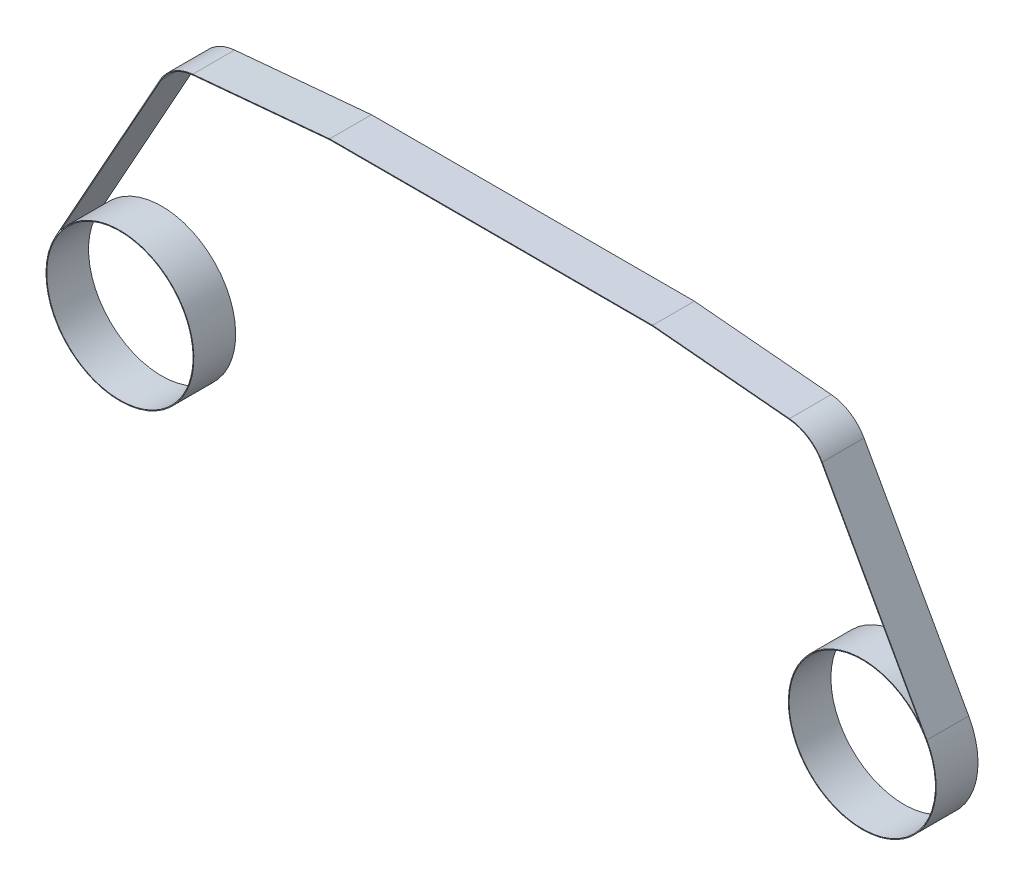
ISO-10303-21;
HEADER;
FILE_DESCRIPTION(('STEP AP214'),'2;1');
FILE_NAME('part.step','',(''),(''),'','','');
FILE_SCHEMA(('AUTOMOTIVE_DESIGN { 1 0 10303 214 1 1 1 1 }'));
ENDSEC;
DATA;
#1=APPLICATION_CONTEXT('core data for automotive mechanical design processes');
#2=APPLICATION_PROTOCOL_DEFINITION('international standard','automotive_design',2000,#1);
#3=PRODUCT_CONTEXT('',#1,'mechanical');
#4=PRODUCT('Part','Part','',(#3));
#5=PRODUCT_RELATED_PRODUCT_CATEGORY('part','',(#4));
#6=PRODUCT_DEFINITION_FORMATION('','',#4);
#7=PRODUCT_DEFINITION_CONTEXT('part definition',#1,'design');
#8=PRODUCT_DEFINITION('design','',#6,#7);
#9=PRODUCT_DEFINITION_SHAPE('','',#8);
#10=(LENGTH_UNIT() NAMED_UNIT(*) SI_UNIT(.MILLI.,.METRE.));
#11=(NAMED_UNIT(*) PLANE_ANGLE_UNIT() SI_UNIT($,.RADIAN.));
#12=(NAMED_UNIT(*) SI_UNIT($,.STERADIAN.) SOLID_ANGLE_UNIT());
#13=UNCERTAINTY_MEASURE_WITH_UNIT(LENGTH_MEASURE(1.E-05),#10,'distance_accuracy_value','');
#14=(GEOMETRIC_REPRESENTATION_CONTEXT(3) GLOBAL_UNCERTAINTY_ASSIGNED_CONTEXT((#13)) GLOBAL_UNIT_ASSIGNED_CONTEXT((#10,
#11,#12)) REPRESENTATION_CONTEXT('',''));
#15=CARTESIAN_POINT('',(0.,0.,0.));
#16=DIRECTION('',(0.,0.,1.));
#17=DIRECTION('',(1.,0.,0.));
#18=AXIS2_PLACEMENT_3D('',#15,#16,#17);
#19=CARTESIAN_POINT('',(35.5,0.,2.));
#20=DIRECTION('',(0.,0.,-1.));
#21=DIRECTION('',(-1.,0.,0.));
#22=AXIS2_PLACEMENT_3D('',#19,#20,#21);
#23=PLANE('',#22);
#24=CARTESIAN_POINT('',(-35.5,0.,2.));
#25=DIRECTION('',(0.,0.,1.));
#26=DIRECTION('',(1.,0.,0.));
#27=AXIS2_PLACEMENT_3D('',#24,#25,#26);
#28=CIRCLE('',#27,7.);
#29=CARTESIAN_POINT('',(-28.5,0.,2.));
#30=VERTEX_POINT('',#29);
#31=EDGE_CURVE('E183',#30,#30,#28,.T.);
#32=ORIENTED_EDGE('',*,*,#31,.F.);
#33=EDGE_LOOP('',(#32));
#34=FACE_BOUND('',#33,.T.);
#35=CARTESIAN_POINT('',(35.5,0.,2.));
#36=DIRECTION('',(0.,0.,1.));
#37=DIRECTION('',(-1.,0.,0.));
#38=AXIS2_PLACEMENT_3D('',#35,#36,#37);
#39=CIRCLE('',#38,7.06999999999999);
#40=CARTESIAN_POINT('',(41.1355776537474,4.26909410865856,2.));
#41=VERTEX_POINT('',#40);
#42=CARTESIAN_POINT('',(41.679035844759,3.43575552523505,2.));
#43=VERTEX_POINT('',#42);
#44=EDGE_CURVE('E210',#41,#43,#39,.T.);
#45=ORIENTED_EDGE('',*,*,#44,.T.);
#46=DIRECTION('',(-0.485962591971012,0.873979610291233,0.));
#47=VECTOR('',#46,1.);
#48=CARTESIAN_POINT('',(31.6659184411649,21.443850367884,2.));
#49=LINE('',#48,#47);
#50=CARTESIAN_POINT('',(31.6659184411649,21.443850367884,2.));
#51=VERTEX_POINT('',#50);
#52=EDGE_CURVE('E118',#43,#51,#49,.T.);
#53=ORIENTED_EDGE('',*,*,#52,.T.);
#54=CARTESIAN_POINT('',(28.17,19.5,2.));
#55=DIRECTION('',(0.,0.,1.));
#56=DIRECTION('',(-1.,0.,0.));
#57=AXIS2_PLACEMENT_3D('',#54,#55,#56);
#58=CIRCLE('',#57,4.);
#59=CARTESIAN_POINT('',(28.5310758735914,23.4836696918181,2.));
#60=VERTEX_POINT('',#59);
#61=EDGE_CURVE('E249',#51,#60,#58,.T.);
#62=ORIENTED_EDGE('',*,*,#61,.T.);
#63=DIRECTION('',(-0.995917422954527,0.0902689683978592,0.));
#64=VECTOR('',#63,1.);
#65=CARTESIAN_POINT('',(28.5310758735914,23.4836696918181,2.));
#66=LINE('',#65,#64);
#67=CARTESIAN_POINT('',(15.44255781177,24.67,2.));
#68=VERTEX_POINT('',#67);
#69=EDGE_CURVE('E268',#60,#68,#66,.T.);
#70=ORIENTED_EDGE('',*,*,#69,.T.);
#71=DIRECTION('',(-1.,0.,0.));
#72=VECTOR('',#71,1.);
#73=CARTESIAN_POINT('',(-15.44255781177,24.67,2.));
#74=LINE('',#73,#72);
#75=CARTESIAN_POINT('',(-15.44255781177,24.67,2.));
#76=VERTEX_POINT('',#75);
#77=EDGE_CURVE('E265',#68,#76,#74,.T.);
#78=ORIENTED_EDGE('',*,*,#77,.T.);
#79=DIRECTION('',(-0.995917422954527,-0.0902689683978592,0.));
#80=VECTOR('',#79,1.);
#81=CARTESIAN_POINT('',(-28.5310758735914,23.4836696918181,2.));
#82=LINE('',#81,#80);
#83=CARTESIAN_POINT('',(-28.5310758735914,23.4836696918181,2.));
#84=VERTEX_POINT('',#83);
#85=EDGE_CURVE('E267',#76,#84,#82,.T.);
#86=ORIENTED_EDGE('',*,*,#85,.T.);
#87=CARTESIAN_POINT('',(-28.17,19.5,2.));
#88=DIRECTION('',(0.,0.,1.));
#89=DIRECTION('',(1.,0.,0.));
#90=AXIS2_PLACEMENT_3D('',#87,#88,#89);
#91=CIRCLE('',#90,4.);
#92=CARTESIAN_POINT('',(-31.6659184411649,21.443850367884,2.));
#93=VERTEX_POINT('',#92);
#94=EDGE_CURVE('E270',#84,#93,#91,.T.);
#95=ORIENTED_EDGE('',*,*,#94,.T.);
#96=DIRECTION('',(-0.485962591971012,-0.873979610291233,0.));
#97=VECTOR('',#96,1.);
#98=CARTESIAN_POINT('',(-31.6659184411649,21.443850367884,2.));
#99=LINE('',#98,#97);
#100=CARTESIAN_POINT('',(-41.679035844759,3.43575552523504,2.));
#101=VERTEX_POINT('',#100);
#102=EDGE_CURVE('E276',#93,#101,#99,.T.);
#103=ORIENTED_EDGE('',*,*,#102,.T.);
#104=CARTESIAN_POINT('',(-35.5,0.,2.));
#105=DIRECTION('',(0.,0.,1.));
#106=DIRECTION('',(1.,0.,0.));
#107=AXIS2_PLACEMENT_3D('',#104,#105,#106);
#108=CIRCLE('',#107,7.06999999999999);
#109=CARTESIAN_POINT('',(-41.1355776537474,4.26909410865856,2.));
#110=VERTEX_POINT('',#109);
#111=EDGE_CURVE('E278',#101,#110,#108,.T.);
#112=ORIENTED_EDGE('',*,*,#111,.T.);
#113=DIRECTION('',(0.485962591971012,0.873979610291233,0.));
#114=VECTOR('',#113,1.);
#115=CARTESIAN_POINT('',(-31.6047398684445,21.4098329864461,2.));
#116=LINE('',#115,#114);
#117=CARTESIAN_POINT('',(-31.6047398684445,21.4098329864461,2.));
#118=VERTEX_POINT('',#117);
#119=EDGE_CURVE('E280',#110,#118,#116,.T.);
#120=ORIENTED_EDGE('',*,*,#119,.T.);
#121=CARTESIAN_POINT('',(-28.17,19.5,2.));
#122=DIRECTION('',(0.,0.,-1.));
#123=DIRECTION('',(1.,0.,0.));
#124=AXIS2_PLACEMENT_3D('',#121,#122,#123);
#125=CIRCLE('',#124,3.93);
#126=CARTESIAN_POINT('',(-28.5247570458036,23.4139554722113,2.));
#127=VERTEX_POINT('',#126);
#128=EDGE_CURVE('E282',#118,#127,#125,.T.);
#129=ORIENTED_EDGE('',*,*,#128,.T.);
#130=DIRECTION('',(0.995917422954527,0.0902689683978593,0.));
#131=VECTOR('',#130,1.);
#132=CARTESIAN_POINT('',(-28.5247570458036,23.4139554722113,2.));
#133=LINE('',#132,#131);
#134=CARTESIAN_POINT('',(-15.4393919354091,24.6,2.));
#135=VERTEX_POINT('',#134);
#136=EDGE_CURVE('E284',#127,#135,#133,.T.);
#137=ORIENTED_EDGE('',*,*,#136,.T.);
#138=DIRECTION('',(1.,0.,0.));
#139=VECTOR('',#138,1.);
#140=CARTESIAN_POINT('',(-15.4393919354091,24.6,2.));
#141=LINE('',#140,#139);
#142=CARTESIAN_POINT('',(15.4393919354091,24.6,2.));
#143=VERTEX_POINT('',#142);
#144=EDGE_CURVE('E161',#135,#143,#141,.T.);
#145=ORIENTED_EDGE('',*,*,#144,.T.);
#146=DIRECTION('',(0.995917422954527,-0.0902689683978593,0.));
#147=VECTOR('',#146,1.);
#148=CARTESIAN_POINT('',(28.5247570458036,23.4139554722113,2.));
#149=LINE('',#148,#147);
#150=CARTESIAN_POINT('',(28.5247570458036,23.4139554722113,2.));
#151=VERTEX_POINT('',#150);
#152=EDGE_CURVE('E155',#143,#151,#149,.T.);
#153=ORIENTED_EDGE('',*,*,#152,.T.);
#154=CARTESIAN_POINT('',(28.17,19.5,2.));
#155=DIRECTION('',(0.,0.,-1.));
#156=DIRECTION('',(-1.,0.,0.));
#157=AXIS2_PLACEMENT_3D('',#154,#155,#156);
#158=CIRCLE('',#157,3.93);
#159=CARTESIAN_POINT('',(31.6047398684445,21.4098329864461,2.));
#160=VERTEX_POINT('',#159);
#161=EDGE_CURVE('E159',#151,#160,#158,.T.);
#162=ORIENTED_EDGE('',*,*,#161,.T.);
#163=DIRECTION('',(0.485962591971012,-0.873979610291233,0.));
#164=VECTOR('',#163,1.);
#165=CARTESIAN_POINT('',(31.6047398684445,21.4098329864461,2.));
#166=LINE('',#165,#164);
#167=EDGE_CURVE('E51',#160,#41,#166,.T.);
#168=ORIENTED_EDGE('',*,*,#167,.T.);
#169=EDGE_LOOP('',(#45,#53,#62,#70,#78,#86,#95,#103,#112,#120,#129,#137,#145,#153,#162,#168));
#170=FACE_BOUND('',#169,.T.);
#171=CARTESIAN_POINT('',(35.5,0.,2.));
#172=DIRECTION('',(0.,0.,1.));
#173=DIRECTION('',(-1.,0.,0.));
#174=AXIS2_PLACEMENT_3D('',#171,#172,#173);
#175=CIRCLE('',#174,7.);
#176=CARTESIAN_POINT('',(28.5,0.,2.));
#177=VERTEX_POINT('',#176);
#178=EDGE_CURVE('E327',#177,#177,#175,.T.);
#179=ORIENTED_EDGE('',*,*,#178,.F.);
#180=EDGE_LOOP('',(#179));
#181=FACE_BOUND('',#180,.T.);
#182=ADVANCED_FACE('F34',(#34,#170,#181),#23,.F.);
#183=CARTESIAN_POINT('',(35.5,0.,-2.));
#184=DIRECTION('',(0.,0.,-1.));
#185=DIRECTION('',(-1.,0.,0.));
#186=AXIS2_PLACEMENT_3D('',#183,#184,#185);
#187=PLANE('',#186);
#188=CARTESIAN_POINT('',(-35.5,0.,-2.));
#189=DIRECTION('',(0.,0.,1.));
#190=DIRECTION('',(1.,0.,0.));
#191=AXIS2_PLACEMENT_3D('',#188,#189,#190);
#192=CIRCLE('',#191,7.);
#193=CARTESIAN_POINT('',(-28.5,0.,-2.));
#194=VERTEX_POINT('',#193);
#195=EDGE_CURVE('E332',#194,#194,#192,.T.);
#196=ORIENTED_EDGE('',*,*,#195,.T.);
#197=EDGE_LOOP('',(#196));
#198=FACE_BOUND('',#197,.T.);
#199=CARTESIAN_POINT('',(35.5,0.,-2.));
#200=DIRECTION('',(0.,0.,1.));
#201=DIRECTION('',(-1.,0.,0.));
#202=AXIS2_PLACEMENT_3D('',#199,#200,#201);
#203=CIRCLE('',#202,7.06999999999999);
#204=CARTESIAN_POINT('',(41.1355776537474,4.26909410865856,-2.));
#205=VERTEX_POINT('',#204);
#206=CARTESIAN_POINT('',(41.679035844759,3.43575552523505,-2.));
#207=VERTEX_POINT('',#206);
#208=EDGE_CURVE('E179',#205,#207,#203,.T.);
#209=ORIENTED_EDGE('',*,*,#208,.F.);
#210=DIRECTION('',(0.485962591971012,-0.873979610291233,0.));
#211=VECTOR('',#210,1.);
#212=CARTESIAN_POINT('',(31.6047398684445,21.4098329864461,-2.));
#213=LINE('',#212,#211);
#214=CARTESIAN_POINT('',(31.6047398684445,21.4098329864461,-2.));
#215=VERTEX_POINT('',#214);
#216=EDGE_CURVE('E110',#215,#205,#213,.T.);
#217=ORIENTED_EDGE('',*,*,#216,.F.);
#218=CARTESIAN_POINT('',(28.17,19.5,-2.));
#219=DIRECTION('',(0.,0.,-1.));
#220=DIRECTION('',(-1.,0.,0.));
#221=AXIS2_PLACEMENT_3D('',#218,#219,#220);
#222=CIRCLE('',#221,3.93);
#223=CARTESIAN_POINT('',(28.5247570458036,23.4139554722113,-2.));
#224=VERTEX_POINT('',#223);
#225=EDGE_CURVE('E104',#224,#215,#222,.T.);
#226=ORIENTED_EDGE('',*,*,#225,.F.);
#227=DIRECTION('',(0.995917422954527,-0.0902689683978593,0.));
#228=VECTOR('',#227,1.);
#229=CARTESIAN_POINT('',(28.5247570458036,23.4139554722113,-2.));
#230=LINE('',#229,#228);
#231=CARTESIAN_POINT('',(15.4393919354091,24.6,-2.));
#232=VERTEX_POINT('',#231);
#233=EDGE_CURVE('E169',#232,#224,#230,.T.);
#234=ORIENTED_EDGE('',*,*,#233,.F.);
#235=DIRECTION('',(1.,0.,0.));
#236=VECTOR('',#235,1.);
#237=CARTESIAN_POINT('',(-15.4393919354091,24.6,-2.));
#238=LINE('',#237,#236);
#239=CARTESIAN_POINT('',(-15.4393919354091,24.6,-2.));
#240=VERTEX_POINT('',#239);
#241=EDGE_CURVE('E205',#240,#232,#238,.T.);
#242=ORIENTED_EDGE('',*,*,#241,.F.);
#243=DIRECTION('',(0.995917422954527,0.0902689683978593,0.));
#244=VECTOR('',#243,1.);
#245=CARTESIAN_POINT('',(-28.5247570458036,23.4139554722113,-2.));
#246=LINE('',#245,#244);
#247=CARTESIAN_POINT('',(-28.5247570458036,23.4139554722113,-2.));
#248=VERTEX_POINT('',#247);
#249=EDGE_CURVE('E203',#248,#240,#246,.T.);
#250=ORIENTED_EDGE('',*,*,#249,.F.);
#251=CARTESIAN_POINT('',(-28.17,19.5,-2.));
#252=DIRECTION('',(0.,0.,-1.));
#253=DIRECTION('',(1.,0.,0.));
#254=AXIS2_PLACEMENT_3D('',#251,#252,#253);
#255=CIRCLE('',#254,3.93);
#256=CARTESIAN_POINT('',(-31.6047398684445,21.4098329864461,-2.));
#257=VERTEX_POINT('',#256);
#258=EDGE_CURVE('E201',#257,#248,#255,.T.);
#259=ORIENTED_EDGE('',*,*,#258,.F.);
#260=DIRECTION('',(0.485962591971012,0.873979610291233,0.));
#261=VECTOR('',#260,1.);
#262=CARTESIAN_POINT('',(-31.6047398684445,21.4098329864461,-2.));
#263=LINE('',#262,#261);
#264=CARTESIAN_POINT('',(-41.1355776537474,4.26909410865856,-2.));
#265=VERTEX_POINT('',#264);
#266=EDGE_CURVE('E199',#265,#257,#263,.T.);
#267=ORIENTED_EDGE('',*,*,#266,.F.);
#268=CARTESIAN_POINT('',(-35.5,0.,-2.));
#269=DIRECTION('',(0.,0.,1.));
#270=DIRECTION('',(1.,0.,0.));
#271=AXIS2_PLACEMENT_3D('',#268,#269,#270);
#272=CIRCLE('',#271,7.06999999999999);
#273=CARTESIAN_POINT('',(-41.679035844759,3.43575552523504,-2.));
#274=VERTEX_POINT('',#273);
#275=EDGE_CURVE('E197',#274,#265,#272,.T.);
#276=ORIENTED_EDGE('',*,*,#275,.F.);
#277=DIRECTION('',(-0.485962591971012,-0.873979610291233,0.));
#278=VECTOR('',#277,1.);
#279=CARTESIAN_POINT('',(-31.6659184411649,21.443850367884,-2.));
#280=LINE('',#279,#278);
#281=CARTESIAN_POINT('',(-31.6659184411649,21.443850367884,-2.));
#282=VERTEX_POINT('',#281);
#283=EDGE_CURVE('E195',#282,#274,#280,.T.);
#284=ORIENTED_EDGE('',*,*,#283,.F.);
#285=CARTESIAN_POINT('',(-28.17,19.5,-2.));
#286=DIRECTION('',(0.,0.,1.));
#287=DIRECTION('',(1.,0.,0.));
#288=AXIS2_PLACEMENT_3D('',#285,#286,#287);
#289=CIRCLE('',#288,4.);
#290=CARTESIAN_POINT('',(-28.5310758735914,23.4836696918181,-2.));
#291=VERTEX_POINT('',#290);
#292=EDGE_CURVE('E193',#291,#282,#289,.T.);
#293=ORIENTED_EDGE('',*,*,#292,.F.);
#294=DIRECTION('',(-0.995917422954527,-0.0902689683978592,0.));
#295=VECTOR('',#294,1.);
#296=CARTESIAN_POINT('',(-28.5310758735914,23.4836696918181,-2.));
#297=LINE('',#296,#295);
#298=CARTESIAN_POINT('',(-15.44255781177,24.67,-2.));
#299=VERTEX_POINT('',#298);
#300=EDGE_CURVE('E191',#299,#291,#297,.T.);
#301=ORIENTED_EDGE('',*,*,#300,.F.);
#302=DIRECTION('',(-1.,0.,0.));
#303=VECTOR('',#302,1.);
#304=CARTESIAN_POINT('',(-15.44255781177,24.67,-2.));
#305=LINE('',#304,#303);
#306=CARTESIAN_POINT('',(15.44255781177,24.67,-2.));
#307=VERTEX_POINT('',#306);
#308=EDGE_CURVE('E189',#307,#299,#305,.T.);
#309=ORIENTED_EDGE('',*,*,#308,.F.);
#310=DIRECTION('',(-0.995917422954527,0.0902689683978592,0.));
#311=VECTOR('',#310,1.);
#312=CARTESIAN_POINT('',(28.5310758735914,23.4836696918181,-2.));
#313=LINE('',#312,#311);
#314=CARTESIAN_POINT('',(28.5310758735914,23.4836696918181,-2.));
#315=VERTEX_POINT('',#314);
#316=EDGE_CURVE('E187',#315,#307,#313,.T.);
#317=ORIENTED_EDGE('',*,*,#316,.F.);
#318=CARTESIAN_POINT('',(28.17,19.5,-2.));
#319=DIRECTION('',(0.,0.,1.));
#320=DIRECTION('',(-1.,0.,0.));
#321=AXIS2_PLACEMENT_3D('',#318,#319,#320);
#322=CIRCLE('',#321,4.);
#323=CARTESIAN_POINT('',(31.6659184411649,21.443850367884,-2.));
#324=VERTEX_POINT('',#323);
#325=EDGE_CURVE('E185',#324,#315,#322,.T.);
#326=ORIENTED_EDGE('',*,*,#325,.F.);
#327=DIRECTION('',(-0.485962591971012,0.873979610291233,0.));
#328=VECTOR('',#327,1.);
#329=CARTESIAN_POINT('',(31.6659184411649,21.443850367884,-2.));
#330=LINE('',#329,#328);
#331=EDGE_CURVE('E182',#207,#324,#330,.T.);
#332=ORIENTED_EDGE('',*,*,#331,.F.);
#333=EDGE_LOOP('',(#209,#217,#226,#234,#242,#250,#259,#267,#276,#284,#293,#301,#309,#317,#326,#332));
#334=FACE_BOUND('',#333,.T.);
#335=CARTESIAN_POINT('',(35.5,0.,-2.));
#336=DIRECTION('',(0.,0.,1.));
#337=DIRECTION('',(-1.,0.,0.));
#338=AXIS2_PLACEMENT_3D('',#335,#336,#337);
#339=CIRCLE('',#338,7.);
#340=CARTESIAN_POINT('',(28.5,0.,-2.));
#341=VERTEX_POINT('',#340);
#342=EDGE_CURVE('E330',#341,#341,#339,.T.);
#343=ORIENTED_EDGE('',*,*,#342,.T.);
#344=EDGE_LOOP('',(#343));
#345=FACE_BOUND('',#344,.T.);
#346=ADVANCED_FACE('F253',(#198,#334,#345),#187,.T.);
#347=CARTESIAN_POINT('',(35.5,0.,2.));
#348=DIRECTION('',(0.,0.,-1.));
#349=DIRECTION('',(-1.,0.,0.));
#350=AXIS2_PLACEMENT_3D('',#347,#348,#349);
#351=CYLINDRICAL_SURFACE('',#350,7.06999999999999);
#352=ORIENTED_EDGE('',*,*,#208,.T.);
#353=DIRECTION('',(0.,0.,-1.));
#354=VECTOR('',#353,1.);
#355=CARTESIAN_POINT('',(41.679035844759,3.43575552523505,2.));
#356=LINE('',#355,#354);
#357=EDGE_CURVE('E11',#43,#207,#356,.T.);
#358=ORIENTED_EDGE('',*,*,#357,.F.);
#359=ORIENTED_EDGE('',*,*,#44,.F.);
#360=DIRECTION('',(0.,0.,-1.));
#361=VECTOR('',#360,1.);
#362=CARTESIAN_POINT('',(41.1355776537474,4.26909410865856,2.));
#363=LINE('',#362,#361);
#364=EDGE_CURVE('E175',#41,#205,#363,.T.);
#365=ORIENTED_EDGE('',*,*,#364,.T.);
#366=EDGE_LOOP('',(#352,#358,#359,#365));
#367=FACE_BOUND('',#366,.T.);
#368=ADVANCED_FACE('F36',(#367),#351,.T.);
#369=CARTESIAN_POINT('',(31.6659184411649,21.443850367884,2.));
#370=DIRECTION('',(-0.873979610291233,-0.485962591971012,0.));
#371=DIRECTION('',(0.485962591971012,-0.873979610291233,0.));
#372=AXIS2_PLACEMENT_3D('',#369,#370,#371);
#373=PLANE('',#372);
#374=ORIENTED_EDGE('',*,*,#331,.T.);
#375=DIRECTION('',(0.,0.,-1.));
#376=VECTOR('',#375,1.);
#377=CARTESIAN_POINT('',(31.6659184411649,21.443850367884,2.));
#378=LINE('',#377,#376);
#379=EDGE_CURVE('E43',#51,#324,#378,.T.);
#380=ORIENTED_EDGE('',*,*,#379,.F.);
#381=ORIENTED_EDGE('',*,*,#52,.F.);
#382=ORIENTED_EDGE('',*,*,#357,.T.);
#383=EDGE_LOOP('',(#374,#380,#381,#382));
#384=FACE_BOUND('',#383,.T.);
#385=ADVANCED_FACE('F465',(#384),#373,.F.);
#386=CARTESIAN_POINT('',(28.17,19.5,2.));
#387=DIRECTION('',(0.,0.,-1.));
#388=DIRECTION('',(-1.,0.,0.));
#389=AXIS2_PLACEMENT_3D('',#386,#387,#388);
#390=CYLINDRICAL_SURFACE('',#389,4.);
#391=ORIENTED_EDGE('',*,*,#325,.T.);
#392=DIRECTION('',(0.,0.,-1.));
#393=VECTOR('',#392,1.);
#394=CARTESIAN_POINT('',(28.5310758735914,23.4836696918181,2.));
#395=LINE('',#394,#393);
#396=EDGE_CURVE('E241',#60,#315,#395,.T.);
#397=ORIENTED_EDGE('',*,*,#396,.F.);
#398=ORIENTED_EDGE('',*,*,#61,.F.);
#399=ORIENTED_EDGE('',*,*,#379,.T.);
#400=EDGE_LOOP('',(#391,#397,#398,#399));
#401=FACE_BOUND('',#400,.T.);
#402=ADVANCED_FACE('F247',(#401),#390,.T.);
#403=CARTESIAN_POINT('',(28.5310758735914,23.4836696918181,2.));
#404=DIRECTION('',(-0.0902689683978592,-0.995917422954527,0.));
#405=DIRECTION('',(0.995917422954527,-0.0902689683978592,0.));
#406=AXIS2_PLACEMENT_3D('',#403,#404,#405);
#407=PLANE('',#406);
#408=ORIENTED_EDGE('',*,*,#316,.T.);
#409=DIRECTION('',(0.,0.,-1.));
#410=VECTOR('',#409,1.);
#411=CARTESIAN_POINT('',(15.44255781177,24.67,2.));
#412=LINE('',#411,#410);
#413=EDGE_CURVE('E238',#68,#307,#412,.T.);
#414=ORIENTED_EDGE('',*,*,#413,.F.);
#415=ORIENTED_EDGE('',*,*,#69,.F.);
#416=ORIENTED_EDGE('',*,*,#396,.T.);
#417=EDGE_LOOP('',(#408,#414,#415,#416));
#418=FACE_BOUND('',#417,.T.);
#419=ADVANCED_FACE('F259',(#418),#407,.F.);
#420=CARTESIAN_POINT('',(-15.44255781177,24.67,2.));
#421=DIRECTION('',(0.,-1.,0.));
#422=DIRECTION('',(0.,0.,-1.));
#423=AXIS2_PLACEMENT_3D('',#420,#421,#422);
#424=PLANE('',#423);
#425=ORIENTED_EDGE('',*,*,#308,.T.);
#426=DIRECTION('',(0.,0.,-1.));
#427=VECTOR('',#426,1.);
#428=CARTESIAN_POINT('',(-15.44255781177,24.67,2.));
#429=LINE('',#428,#427);
#430=EDGE_CURVE('E235',#76,#299,#429,.T.);
#431=ORIENTED_EDGE('',*,*,#430,.F.);
#432=ORIENTED_EDGE('',*,*,#77,.F.);
#433=ORIENTED_EDGE('',*,*,#413,.T.);
#434=EDGE_LOOP('',(#425,#431,#432,#433));
#435=FACE_BOUND('',#434,.T.);
#436=ADVANCED_FACE('F263',(#435),#424,.F.);
#437=CARTESIAN_POINT('',(-28.5310758735914,23.4836696918181,2.));
#438=DIRECTION('',(0.0902689683978592,-0.995917422954527,0.));
#439=DIRECTION('',(0.995917422954527,0.0902689683978592,0.));
#440=AXIS2_PLACEMENT_3D('',#437,#438,#439);
#441=PLANE('',#440);
#442=ORIENTED_EDGE('',*,*,#300,.T.);
#443=DIRECTION('',(0.,0.,-1.));
#444=VECTOR('',#443,1.);
#445=CARTESIAN_POINT('',(-28.5310758735914,23.4836696918181,2.));
#446=LINE('',#445,#444);
#447=EDGE_CURVE('E232',#84,#291,#446,.T.);
#448=ORIENTED_EDGE('',*,*,#447,.F.);
#449=ORIENTED_EDGE('',*,*,#85,.F.);
#450=ORIENTED_EDGE('',*,*,#430,.T.);
#451=EDGE_LOOP('',(#442,#448,#449,#450));
#452=FACE_BOUND('',#451,.T.);
#453=ADVANCED_FACE('F430',(#452),#441,.F.);
#454=CARTESIAN_POINT('',(-28.17,19.5,2.));
#455=DIRECTION('',(0.,0.,-1.));
#456=DIRECTION('',(-1.,0.,0.));
#457=AXIS2_PLACEMENT_3D('',#454,#455,#456);
#458=CYLINDRICAL_SURFACE('',#457,4.);
#459=ORIENTED_EDGE('',*,*,#292,.T.);
#460=DIRECTION('',(0.,0.,-1.));
#461=VECTOR('',#460,1.);
#462=CARTESIAN_POINT('',(-31.6659184411649,21.443850367884,2.));
#463=LINE('',#462,#461);
#464=EDGE_CURVE('E229',#93,#282,#463,.T.);
#465=ORIENTED_EDGE('',*,*,#464,.F.);
#466=ORIENTED_EDGE('',*,*,#94,.F.);
#467=ORIENTED_EDGE('',*,*,#447,.T.);
#468=EDGE_LOOP('',(#459,#465,#466,#467));
#469=FACE_BOUND('',#468,.T.);
#470=ADVANCED_FACE('F420',(#469),#458,.T.);
#471=CARTESIAN_POINT('',(-31.6659184411649,21.443850367884,2.));
#472=DIRECTION('',(0.873979610291233,-0.485962591971012,0.));
#473=DIRECTION('',(0.485962591971012,0.873979610291233,0.));
#474=AXIS2_PLACEMENT_3D('',#471,#472,#473);
#475=PLANE('',#474);
#476=ORIENTED_EDGE('',*,*,#283,.T.);
#477=DIRECTION('',(0.,0.,-1.));
#478=VECTOR('',#477,1.);
#479=CARTESIAN_POINT('',(-41.679035844759,3.43575552523504,2.));
#480=LINE('',#479,#478);
#481=EDGE_CURVE('E226',#101,#274,#480,.T.);
#482=ORIENTED_EDGE('',*,*,#481,.F.);
#483=ORIENTED_EDGE('',*,*,#102,.F.);
#484=ORIENTED_EDGE('',*,*,#464,.T.);
#485=EDGE_LOOP('',(#476,#482,#483,#484));
#486=FACE_BOUND('',#485,.T.);
#487=ADVANCED_FACE('F410',(#486),#475,.F.);
#488=CARTESIAN_POINT('',(-35.5,0.,2.));
#489=DIRECTION('',(0.,0.,-1.));
#490=DIRECTION('',(-1.,0.,0.));
#491=AXIS2_PLACEMENT_3D('',#488,#489,#490);
#492=CYLINDRICAL_SURFACE('',#491,7.06999999999999);
#493=ORIENTED_EDGE('',*,*,#275,.T.);
#494=DIRECTION('',(0.,0.,-1.));
#495=VECTOR('',#494,1.);
#496=CARTESIAN_POINT('',(-41.1355776537474,4.26909410865856,2.));
#497=LINE('',#496,#495);
#498=EDGE_CURVE('E223',#110,#265,#497,.T.);
#499=ORIENTED_EDGE('',*,*,#498,.F.);
#500=ORIENTED_EDGE('',*,*,#111,.F.);
#501=ORIENTED_EDGE('',*,*,#481,.T.);
#502=EDGE_LOOP('',(#493,#499,#500,#501));
#503=FACE_BOUND('',#502,.T.);
#504=ADVANCED_FACE('F400',(#503),#492,.T.);
#505=CARTESIAN_POINT('',(-31.6047398684445,21.4098329864461,2.));
#506=DIRECTION('',(-0.873979610291233,0.485962591971012,0.));
#507=DIRECTION('',(-0.485962591971012,-0.873979610291233,0.));
#508=AXIS2_PLACEMENT_3D('',#505,#506,#507);
#509=PLANE('',#508);
#510=ORIENTED_EDGE('',*,*,#266,.T.);
#511=DIRECTION('',(0.,0.,-1.));
#512=VECTOR('',#511,1.);
#513=CARTESIAN_POINT('',(-31.6047398684445,21.4098329864461,2.));
#514=LINE('',#513,#512);
#515=EDGE_CURVE('E220',#118,#257,#514,.T.);
#516=ORIENTED_EDGE('',*,*,#515,.F.);
#517=ORIENTED_EDGE('',*,*,#119,.F.);
#518=ORIENTED_EDGE('',*,*,#498,.T.);
#519=EDGE_LOOP('',(#510,#516,#517,#518));
#520=FACE_BOUND('',#519,.T.);
#521=ADVANCED_FACE('F390',(#520),#509,.F.);
#522=CARTESIAN_POINT('',(-28.17,19.5,2.));
#523=DIRECTION('',(0.,0.,-1.));
#524=DIRECTION('',(-1.,0.,0.));
#525=AXIS2_PLACEMENT_3D('',#522,#523,#524);
#526=CYLINDRICAL_SURFACE('',#525,3.93);
#527=ORIENTED_EDGE('',*,*,#258,.T.);
#528=DIRECTION('',(0.,0.,-1.));
#529=VECTOR('',#528,1.);
#530=CARTESIAN_POINT('',(-28.5247570458036,23.4139554722113,2.));
#531=LINE('',#530,#529);
#532=EDGE_CURVE('E217',#127,#248,#531,.T.);
#533=ORIENTED_EDGE('',*,*,#532,.F.);
#534=ORIENTED_EDGE('',*,*,#128,.F.);
#535=ORIENTED_EDGE('',*,*,#515,.T.);
#536=EDGE_LOOP('',(#527,#533,#534,#535));
#537=FACE_BOUND('',#536,.T.);
#538=ADVANCED_FACE('F381',(#537),#526,.F.);
#539=CARTESIAN_POINT('',(-28.5247570458036,23.4139554722113,2.));
#540=DIRECTION('',(-0.0902689683978593,0.995917422954527,0.));
#541=DIRECTION('',(-0.995917422954527,-0.0902689683978593,0.));
#542=AXIS2_PLACEMENT_3D('',#539,#540,#541);
#543=PLANE('',#542);
#544=ORIENTED_EDGE('',*,*,#249,.T.);
#545=DIRECTION('',(0.,0.,-1.));
#546=VECTOR('',#545,1.);
#547=CARTESIAN_POINT('',(-15.4393919354091,24.6,2.));
#548=LINE('',#547,#546);
#549=EDGE_CURVE('E214',#135,#240,#548,.T.);
#550=ORIENTED_EDGE('',*,*,#549,.F.);
#551=ORIENTED_EDGE('',*,*,#136,.F.);
#552=ORIENTED_EDGE('',*,*,#532,.T.);
#553=EDGE_LOOP('',(#544,#550,#551,#552));
#554=FACE_BOUND('',#553,.T.);
#555=ADVANCED_FACE('F290',(#554),#543,.F.);
#556=CARTESIAN_POINT('',(-15.4393919354091,24.6,2.));
#557=DIRECTION('',(0.,1.,0.));
#558=DIRECTION('',(0.,0.,1.));
#559=AXIS2_PLACEMENT_3D('',#556,#557,#558);
#560=PLANE('',#559);
#561=ORIENTED_EDGE('',*,*,#241,.T.);
#562=DIRECTION('',(0.,0.,-1.));
#563=VECTOR('',#562,1.);
#564=CARTESIAN_POINT('',(15.4393919354091,24.6,2.));
#565=LINE('',#564,#563);
#566=EDGE_CURVE('E170',#143,#232,#565,.T.);
#567=ORIENTED_EDGE('',*,*,#566,.F.);
#568=ORIENTED_EDGE('',*,*,#144,.F.);
#569=ORIENTED_EDGE('',*,*,#549,.T.);
#570=EDGE_LOOP('',(#561,#567,#568,#569));
#571=FACE_BOUND('',#570,.T.);
#572=ADVANCED_FACE('F294',(#571),#560,.F.);
#573=CARTESIAN_POINT('',(28.5247570458036,23.4139554722113,2.));
#574=DIRECTION('',(0.0902689683978593,0.995917422954527,0.));
#575=DIRECTION('',(-0.995917422954527,0.0902689683978593,0.));
#576=AXIS2_PLACEMENT_3D('',#573,#574,#575);
#577=PLANE('',#576);
#578=ORIENTED_EDGE('',*,*,#233,.T.);
#579=DIRECTION('',(0.,0.,-1.));
#580=VECTOR('',#579,1.);
#581=CARTESIAN_POINT('',(28.5247570458036,23.4139554722113,2.));
#582=LINE('',#581,#580);
#583=EDGE_CURVE('E166',#151,#224,#582,.T.);
#584=ORIENTED_EDGE('',*,*,#583,.F.);
#585=ORIENTED_EDGE('',*,*,#152,.F.);
#586=ORIENTED_EDGE('',*,*,#566,.T.);
#587=EDGE_LOOP('',(#578,#584,#585,#586));
#588=FACE_BOUND('',#587,.T.);
#589=ADVANCED_FACE('F167',(#588),#577,.F.);
#590=CARTESIAN_POINT('',(28.17,19.5,2.));
#591=DIRECTION('',(0.,0.,-1.));
#592=DIRECTION('',(-1.,0.,0.));
#593=AXIS2_PLACEMENT_3D('',#590,#591,#592);
#594=CYLINDRICAL_SURFACE('',#593,3.93);
#595=ORIENTED_EDGE('',*,*,#225,.T.);
#596=DIRECTION('',(0.,0.,-1.));
#597=VECTOR('',#596,1.);
#598=CARTESIAN_POINT('',(31.6047398684445,21.4098329864461,2.));
#599=LINE('',#598,#597);
#600=EDGE_CURVE('E171',#160,#215,#599,.T.);
#601=ORIENTED_EDGE('',*,*,#600,.F.);
#602=ORIENTED_EDGE('',*,*,#161,.F.);
#603=ORIENTED_EDGE('',*,*,#583,.T.);
#604=EDGE_LOOP('',(#595,#601,#602,#603));
#605=FACE_BOUND('',#604,.T.);
#606=ADVANCED_FACE('F173',(#605),#594,.F.);
#607=CARTESIAN_POINT('',(31.6047398684445,21.4098329864461,2.));
#608=DIRECTION('',(0.873979610291233,0.485962591971012,0.));
#609=DIRECTION('',(-0.485962591971012,0.873979610291233,0.));
#610=AXIS2_PLACEMENT_3D('',#607,#608,#609);
#611=PLANE('',#610);
#612=ORIENTED_EDGE('',*,*,#216,.T.);
#613=ORIENTED_EDGE('',*,*,#364,.F.);
#614=ORIENTED_EDGE('',*,*,#167,.F.);
#615=ORIENTED_EDGE('',*,*,#600,.T.);
#616=EDGE_LOOP('',(#612,#613,#614,#615));
#617=FACE_BOUND('',#616,.T.);
#618=ADVANCED_FACE('F298',(#617),#611,.F.);
#619=CARTESIAN_POINT('',(-35.5,0.,2.));
#620=DIRECTION('',(0.,0.,-1.));
#621=DIRECTION('',(-1.,0.,0.));
#622=AXIS2_PLACEMENT_3D('',#619,#620,#621);
#623=CYLINDRICAL_SURFACE('',#622,7.);
#624=ORIENTED_EDGE('',*,*,#31,.T.);
#625=EDGE_LOOP('',(#624));
#626=FACE_BOUND('',#625,.T.);
#627=ORIENTED_EDGE('',*,*,#195,.F.);
#628=EDGE_LOOP('',(#627));
#629=FACE_BOUND('',#628,.T.);
#630=ADVANCED_FACE('F300',(#626,#629),#623,.F.);
#631=CARTESIAN_POINT('',(35.5,0.,2.));
#632=DIRECTION('',(0.,0.,-1.));
#633=DIRECTION('',(-1.,0.,0.));
#634=AXIS2_PLACEMENT_3D('',#631,#632,#633);
#635=CYLINDRICAL_SURFACE('',#634,7.);
#636=ORIENTED_EDGE('',*,*,#178,.T.);
#637=EDGE_LOOP('',(#636));
#638=FACE_BOUND('',#637,.T.);
#639=ORIENTED_EDGE('',*,*,#342,.F.);
#640=EDGE_LOOP('',(#639));
#641=FACE_BOUND('',#640,.T.);
#642=ADVANCED_FACE('F306',(#638,#641),#635,.F.);
#643=CLOSED_SHELL('',(#182,#346,#368,#385,#402,#419,#436,#453,#470,#487,#504,#521,#538,#555,
#572,#589,#606,#618,#630,#642));
#644=MANIFOLD_SOLID_BREP('B2',#643);
#645=ADVANCED_BREP_SHAPE_REPRESENTATION('',(#18,#644),#14);
#646=SHAPE_DEFINITION_REPRESENTATION(#9,#645);
ENDSEC;
END-ISO-10303-21;
